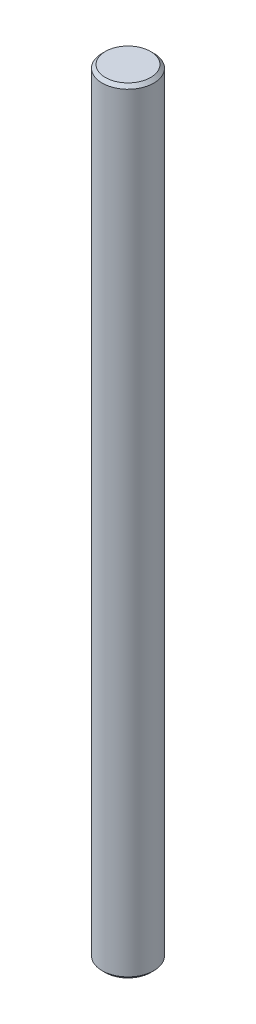
ISO-10303-21;
HEADER;
FILE_DESCRIPTION(('STEP AP214'),'2;1');
FILE_NAME('part.step','',(''),(''),'','','');
FILE_SCHEMA(('AUTOMOTIVE_DESIGN { 1 0 10303 214 1 1 1 1 }'));
ENDSEC;
DATA;
#1=APPLICATION_CONTEXT('core data for automotive mechanical design processes');
#2=APPLICATION_PROTOCOL_DEFINITION('international standard','automotive_design',2000,#1);
#3=PRODUCT_CONTEXT('',#1,'mechanical');
#4=PRODUCT('Part','Part','',(#3));
#5=PRODUCT_RELATED_PRODUCT_CATEGORY('part','',(#4));
#6=PRODUCT_DEFINITION_FORMATION('','',#4);
#7=PRODUCT_DEFINITION_CONTEXT('part definition',#1,'design');
#8=PRODUCT_DEFINITION('design','',#6,#7);
#9=PRODUCT_DEFINITION_SHAPE('','',#8);
#10=(LENGTH_UNIT() NAMED_UNIT(*) SI_UNIT(.MILLI.,.METRE.));
#11=(NAMED_UNIT(*) PLANE_ANGLE_UNIT() SI_UNIT($,.RADIAN.));
#12=(NAMED_UNIT(*) SI_UNIT($,.STERADIAN.) SOLID_ANGLE_UNIT());
#13=UNCERTAINTY_MEASURE_WITH_UNIT(LENGTH_MEASURE(1.E-05),#10,'distance_accuracy_value','');
#14=(GEOMETRIC_REPRESENTATION_CONTEXT(3) GLOBAL_UNCERTAINTY_ASSIGNED_CONTEXT((#13)) GLOBAL_UNIT_ASSIGNED_CONTEXT((#10,
#11,#12)) REPRESENTATION_CONTEXT('',''));
#15=CARTESIAN_POINT('',(0.,0.,0.));
#16=DIRECTION('',(0.,0.,1.));
#17=DIRECTION('',(1.,0.,0.));
#18=AXIS2_PLACEMENT_3D('',#15,#16,#17);
#19=CARTESIAN_POINT('',(0.,30.,0.));
#20=DIRECTION('',(0.,-1.,0.));
#21=DIRECTION('',(0.,0.,-1.));
#22=AXIS2_PLACEMENT_3D('',#19,#20,#21);
#23=CYLINDRICAL_SURFACE('',#22,2.);
#24=CARTESIAN_POINT('',(0.,-29.75,0.));
#25=DIRECTION('',(0.,1.,0.));
#26=DIRECTION('',(0.,0.,1.));
#27=AXIS2_PLACEMENT_3D('',#24,#25,#26);
#28=CIRCLE('',#27,2.);
#29=CARTESIAN_POINT('',(0.,-29.75,2.));
#30=VERTEX_POINT('',#29);
#31=EDGE_CURVE('E46',#30,#30,#28,.T.);
#32=ORIENTED_EDGE('',*,*,#31,.T.);
#33=EDGE_LOOP('',(#32));
#34=FACE_BOUND('',#33,.T.);
#35=CARTESIAN_POINT('',(0.,29.75,0.));
#36=DIRECTION('',(0.,1.,0.));
#37=DIRECTION('',(0.,0.,1.));
#38=AXIS2_PLACEMENT_3D('',#35,#36,#37);
#39=CIRCLE('',#38,2.);
#40=CARTESIAN_POINT('',(0.,29.75,2.));
#41=VERTEX_POINT('',#40);
#42=EDGE_CURVE('E50',#41,#41,#39,.F.);
#43=ORIENTED_EDGE('',*,*,#42,.T.);
#44=EDGE_LOOP('',(#43));
#45=FACE_BOUND('',#44,.T.);
#46=ADVANCED_FACE('F34',(#34,#45),#23,.T.);
#47=CARTESIAN_POINT('',(0.,30.,0.));
#48=DIRECTION('',(0.,1.,0.));
#49=DIRECTION('',(0.,0.,1.));
#50=AXIS2_PLACEMENT_3D('',#47,#48,#49);
#51=PLANE('',#50);
#52=CARTESIAN_POINT('',(0.,30.,0.));
#53=DIRECTION('',(0.,1.,0.));
#54=DIRECTION('',(0.,0.,1.));
#55=AXIS2_PLACEMENT_3D('',#52,#53,#54);
#56=CIRCLE('',#55,1.75000000000001);
#57=CARTESIAN_POINT('',(0.,30.,1.75000000000001));
#58=VERTEX_POINT('',#57);
#59=EDGE_CURVE('E10',#58,#58,#56,.T.);
#60=ORIENTED_EDGE('',*,*,#59,.T.);
#61=EDGE_LOOP('',(#60));
#62=FACE_BOUND('',#61,.T.);
#63=ADVANCED_FACE('F66',(#62),#51,.T.);
#64=CARTESIAN_POINT('',(0.,-30.,0.));
#65=DIRECTION('',(0.,1.,0.));
#66=DIRECTION('',(0.,0.,1.));
#67=AXIS2_PLACEMENT_3D('',#64,#65,#66);
#68=PLANE('',#67);
#69=CARTESIAN_POINT('',(0.,-30.,0.));
#70=DIRECTION('',(0.,1.,0.));
#71=DIRECTION('',(0.,0.,1.));
#72=AXIS2_PLACEMENT_3D('',#69,#70,#71);
#73=CIRCLE('',#72,1.75);
#74=CARTESIAN_POINT('',(0.,-30.,1.75));
#75=VERTEX_POINT('',#74);
#76=EDGE_CURVE('E42',#75,#75,#73,.F.);
#77=ORIENTED_EDGE('',*,*,#76,.T.);
#78=EDGE_LOOP('',(#77));
#79=FACE_BOUND('',#78,.T.);
#80=ADVANCED_FACE('F63',(#79),#68,.F.);
#81=CARTESIAN_POINT('',(0.,-29.75,0.));
#82=DIRECTION('',(0.,1.,0.));
#83=DIRECTION('',(0.,0.,1.));
#84=AXIS2_PLACEMENT_3D('',#81,#82,#83);
#85=CONICAL_SURFACE('',#84,2.,0.785398163397445);
#86=ORIENTED_EDGE('',*,*,#76,.F.);
#87=EDGE_LOOP('',(#86));
#88=FACE_BOUND('',#87,.T.);
#89=ORIENTED_EDGE('',*,*,#31,.F.);
#90=EDGE_LOOP('',(#89));
#91=FACE_BOUND('',#90,.T.);
#92=ADVANCED_FACE('F59',(#88,#91),#85,.T.);
#93=CARTESIAN_POINT('',(0.,30.,0.));
#94=DIRECTION('',(0.,-1.,0.));
#95=DIRECTION('',(0.,0.,-1.));
#96=AXIS2_PLACEMENT_3D('',#93,#94,#95);
#97=CONICAL_SURFACE('',#96,1.75000000000001,0.785398163397445);
#98=ORIENTED_EDGE('',*,*,#42,.F.);
#99=EDGE_LOOP('',(#98));
#100=FACE_BOUND('',#99,.T.);
#101=ORIENTED_EDGE('',*,*,#59,.F.);
#102=EDGE_LOOP('',(#101));
#103=FACE_BOUND('',#102,.T.);
#104=ADVANCED_FACE('F37',(#100,#103),#97,.T.);
#105=CLOSED_SHELL('',(#46,#63,#80,#92,#104));
#106=MANIFOLD_SOLID_BREP('B2',#105);
#107=ADVANCED_BREP_SHAPE_REPRESENTATION('',(#18,#106),#14);
#108=SHAPE_DEFINITION_REPRESENTATION(#9,#107);
ENDSEC;
END-ISO-10303-21;
